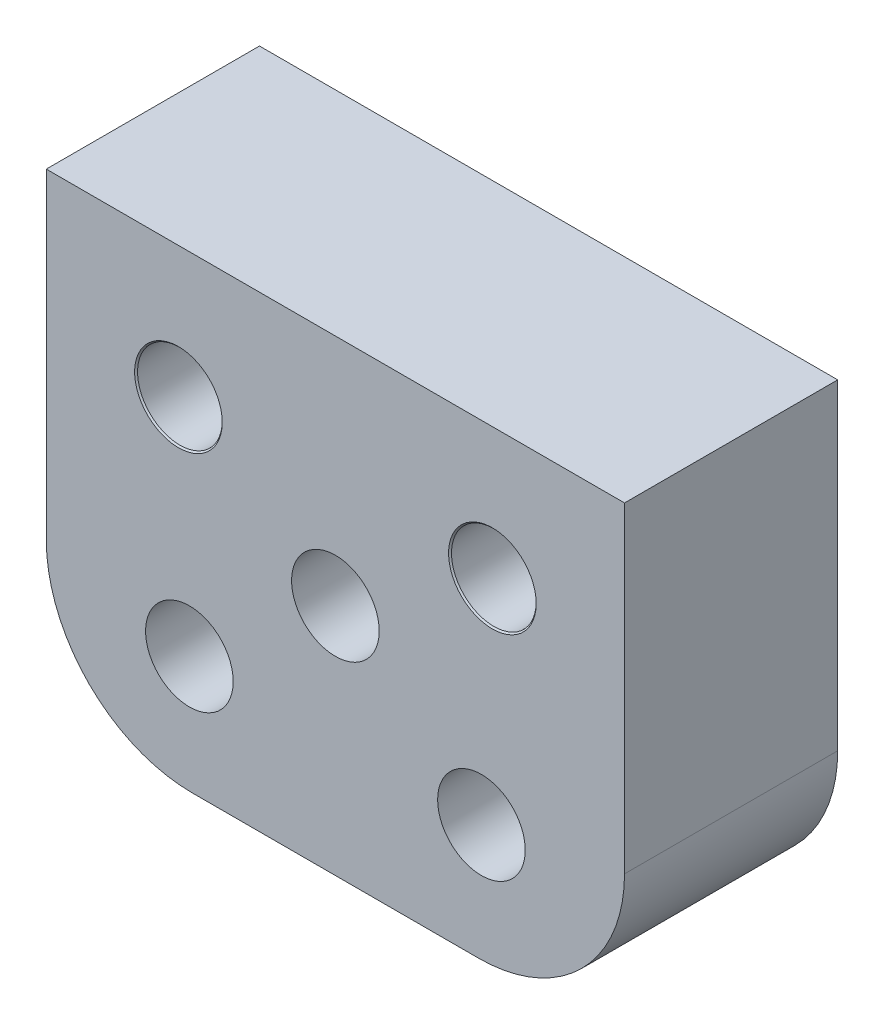
ISO-10303-21;
HEADER;
FILE_DESCRIPTION(('STEP AP214'),'2;1');
FILE_NAME('part.step','',(''),(''),'','','');
FILE_SCHEMA(('AUTOMOTIVE_DESIGN { 1 0 10303 214 1 1 1 1 }'));
ENDSEC;
DATA;
#1=APPLICATION_CONTEXT('core data for automotive mechanical design processes');
#2=APPLICATION_PROTOCOL_DEFINITION('international standard','automotive_design',2000,#1);
#3=PRODUCT_CONTEXT('',#1,'mechanical');
#4=PRODUCT('Part','Part','',(#3));
#5=PRODUCT_RELATED_PRODUCT_CATEGORY('part','',(#4));
#6=PRODUCT_DEFINITION_FORMATION('','',#4);
#7=PRODUCT_DEFINITION_CONTEXT('part definition',#1,'design');
#8=PRODUCT_DEFINITION('design','',#6,#7);
#9=PRODUCT_DEFINITION_SHAPE('','',#8);
#10=(LENGTH_UNIT() NAMED_UNIT(*) SI_UNIT(.MILLI.,.METRE.));
#11=(NAMED_UNIT(*) PLANE_ANGLE_UNIT() SI_UNIT($,.RADIAN.));
#12=(NAMED_UNIT(*) SI_UNIT($,.STERADIAN.) SOLID_ANGLE_UNIT());
#13=UNCERTAINTY_MEASURE_WITH_UNIT(LENGTH_MEASURE(1.E-05),#10,'distance_accuracy_value','');
#14=(GEOMETRIC_REPRESENTATION_CONTEXT(3) GLOBAL_UNCERTAINTY_ASSIGNED_CONTEXT((#13)) GLOBAL_UNIT_ASSIGNED_CONTEXT((#10,
#11,#12)) REPRESENTATION_CONTEXT('',''));
#15=CARTESIAN_POINT('',(0.,0.,0.));
#16=DIRECTION('',(0.,0.,1.));
#17=DIRECTION('',(1.,0.,0.));
#18=AXIS2_PLACEMENT_3D('',#15,#16,#17);
#19=CARTESIAN_POINT('',(19.8,5.00000000000004,-7.3));
#20=DIRECTION('',(1.,0.,0.));
#21=DIRECTION('',(0.,0.,-1.));
#22=AXIS2_PLACEMENT_3D('',#19,#20,#21);
#23=PLANE('',#22);
#24=DIRECTION('',(0.,1.,0.));
#25=VECTOR('',#24,1.);
#26=CARTESIAN_POINT('',(19.8,5.00000000000004,0.));
#27=LINE('',#26,#25);
#28=CARTESIAN_POINT('',(19.8,5.,0.));
#29=VERTEX_POINT('',#28);
#30=CARTESIAN_POINT('',(19.8,16.,0.));
#31=VERTEX_POINT('',#30);
#32=EDGE_CURVE('E121',#29,#31,#27,.T.);
#33=ORIENTED_EDGE('',*,*,#32,.F.);
#34=DIRECTION('',(0.,0.,1.));
#35=VECTOR('',#34,1.);
#36=CARTESIAN_POINT('',(19.8,5.,-7.3));
#37=LINE('',#36,#35);
#38=CARTESIAN_POINT('',(19.8,5.,-7.3));
#39=VERTEX_POINT('',#38);
#40=EDGE_CURVE('E11',#39,#29,#37,.T.);
#41=ORIENTED_EDGE('',*,*,#40,.F.);
#42=DIRECTION('',(0.,1.,0.));
#43=VECTOR('',#42,1.);
#44=CARTESIAN_POINT('',(19.8,5.00000000000004,-7.3));
#45=LINE('',#44,#43);
#46=CARTESIAN_POINT('',(19.8,16.,-7.3));
#47=VERTEX_POINT('',#46);
#48=EDGE_CURVE('E136',#39,#47,#45,.T.);
#49=ORIENTED_EDGE('',*,*,#48,.T.);
#50=DIRECTION('',(0.,0.,1.));
#51=VECTOR('',#50,1.);
#52=CARTESIAN_POINT('',(19.8,16.,-7.3));
#53=LINE('',#52,#51);
#54=EDGE_CURVE('E39',#47,#31,#53,.T.);
#55=ORIENTED_EDGE('',*,*,#54,.T.);
#56=EDGE_LOOP('',(#33,#41,#49,#55));
#57=FACE_BOUND('',#56,.T.);
#58=ADVANCED_FACE('F36',(#57),#23,.T.);
#59=CARTESIAN_POINT('',(14.8,5.,-7.3));
#60=DIRECTION('',(0.,0.,1.));
#61=DIRECTION('',(1.,0.,0.));
#62=AXIS2_PLACEMENT_3D('',#59,#60,#61);
#63=CYLINDRICAL_SURFACE('',#62,5.);
#64=CARTESIAN_POINT('',(14.8,5.,0.));
#65=DIRECTION('',(0.,0.,1.));
#66=DIRECTION('',(1.,0.,0.));
#67=AXIS2_PLACEMENT_3D('',#64,#65,#66);
#68=CIRCLE('',#67,5.);
#69=CARTESIAN_POINT('',(14.8,0.,0.));
#70=VERTEX_POINT('',#69);
#71=EDGE_CURVE('E134',#70,#29,#68,.T.);
#72=ORIENTED_EDGE('',*,*,#71,.F.);
#73=DIRECTION('',(0.,0.,1.));
#74=VECTOR('',#73,1.);
#75=CARTESIAN_POINT('',(14.8,0.,-7.3));
#76=LINE('',#75,#74);
#77=CARTESIAN_POINT('',(14.8,0.,-7.3));
#78=VERTEX_POINT('',#77);
#79=EDGE_CURVE('E45',#78,#70,#76,.T.);
#80=ORIENTED_EDGE('',*,*,#79,.F.);
#81=CARTESIAN_POINT('',(14.8,5.,-7.3));
#82=DIRECTION('',(0.,0.,1.));
#83=DIRECTION('',(1.,0.,0.));
#84=AXIS2_PLACEMENT_3D('',#81,#82,#83);
#85=CIRCLE('',#84,5.);
#86=EDGE_CURVE('E111',#78,#39,#85,.T.);
#87=ORIENTED_EDGE('',*,*,#86,.T.);
#88=ORIENTED_EDGE('',*,*,#40,.T.);
#89=EDGE_LOOP('',(#72,#80,#87,#88));
#90=FACE_BOUND('',#89,.T.);
#91=ADVANCED_FACE('F144',(#90),#63,.T.);
#92=CARTESIAN_POINT('',(5.00000000000004,0.,-7.3));
#93=DIRECTION('',(0.,-1.,0.));
#94=DIRECTION('',(0.,0.,-1.));
#95=AXIS2_PLACEMENT_3D('',#92,#93,#94);
#96=PLANE('',#95);
#97=DIRECTION('',(1.,0.,0.));
#98=VECTOR('',#97,1.);
#99=CARTESIAN_POINT('',(5.00000000000004,0.,0.));
#100=LINE('',#99,#98);
#101=CARTESIAN_POINT('',(5.00000000000003,0.,0.));
#102=VERTEX_POINT('',#101);
#103=EDGE_CURVE('E98',#102,#70,#100,.T.);
#104=ORIENTED_EDGE('',*,*,#103,.F.);
#105=DIRECTION('',(0.,0.,1.));
#106=VECTOR('',#105,1.);
#107=CARTESIAN_POINT('',(5.00000000000003,0.,-7.3));
#108=LINE('',#107,#106);
#109=CARTESIAN_POINT('',(5.00000000000003,0.,-7.3));
#110=VERTEX_POINT('',#109);
#111=EDGE_CURVE('E93',#110,#102,#108,.T.);
#112=ORIENTED_EDGE('',*,*,#111,.F.);
#113=DIRECTION('',(1.,0.,0.));
#114=VECTOR('',#113,1.);
#115=CARTESIAN_POINT('',(5.00000000000004,0.,-7.3));
#116=LINE('',#115,#114);
#117=EDGE_CURVE('E96',#110,#78,#116,.T.);
#118=ORIENTED_EDGE('',*,*,#117,.T.);
#119=ORIENTED_EDGE('',*,*,#79,.T.);
#120=EDGE_LOOP('',(#104,#112,#118,#119));
#121=FACE_BOUND('',#120,.T.);
#122=ADVANCED_FACE('F95',(#121),#96,.T.);
#123=CARTESIAN_POINT('',(5.,5.,-7.3));
#124=DIRECTION('',(0.,0.,1.));
#125=DIRECTION('',(1.,0.,0.));
#126=AXIS2_PLACEMENT_3D('',#123,#124,#125);
#127=CYLINDRICAL_SURFACE('',#126,5.);
#128=CARTESIAN_POINT('',(5.,5.,0.));
#129=DIRECTION('',(0.,0.,1.));
#130=DIRECTION('',(1.,0.,0.));
#131=AXIS2_PLACEMENT_3D('',#128,#129,#130);
#132=CIRCLE('',#131,5.);
#133=CARTESIAN_POINT('',(0.,5.00000000000004,0.));
#134=VERTEX_POINT('',#133);
#135=EDGE_CURVE('E131',#134,#102,#132,.T.);
#136=ORIENTED_EDGE('',*,*,#135,.F.);
#137=DIRECTION('',(0.,0.,1.));
#138=VECTOR('',#137,1.);
#139=CARTESIAN_POINT('',(0.,5.00000000000004,-7.3));
#140=LINE('',#139,#138);
#141=CARTESIAN_POINT('',(0.,5.00000000000004,-7.3));
#142=VERTEX_POINT('',#141);
#143=EDGE_CURVE('E103',#142,#134,#140,.T.);
#144=ORIENTED_EDGE('',*,*,#143,.F.);
#145=CARTESIAN_POINT('',(5.,5.,-7.3));
#146=DIRECTION('',(0.,0.,1.));
#147=DIRECTION('',(1.,0.,0.));
#148=AXIS2_PLACEMENT_3D('',#145,#146,#147);
#149=CIRCLE('',#148,5.);
#150=EDGE_CURVE('E109',#142,#110,#149,.T.);
#151=ORIENTED_EDGE('',*,*,#150,.T.);
#152=ORIENTED_EDGE('',*,*,#111,.T.);
#153=EDGE_LOOP('',(#136,#144,#151,#152));
#154=FACE_BOUND('',#153,.T.);
#155=ADVANCED_FACE('F113',(#154),#127,.T.);
#156=CARTESIAN_POINT('',(0.,5.00000000000004,-7.3));
#157=DIRECTION('',(-1.,0.,0.));
#158=DIRECTION('',(0.,0.,1.));
#159=AXIS2_PLACEMENT_3D('',#156,#157,#158);
#160=PLANE('',#159);
#161=DIRECTION('',(0.,-1.,0.));
#162=VECTOR('',#161,1.);
#163=CARTESIAN_POINT('',(0.,5.00000000000004,0.));
#164=LINE('',#163,#162);
#165=CARTESIAN_POINT('',(0.,16.,0.));
#166=VERTEX_POINT('',#165);
#167=EDGE_CURVE('E128',#166,#134,#164,.T.);
#168=ORIENTED_EDGE('',*,*,#167,.F.);
#169=DIRECTION('',(0.,0.,1.));
#170=VECTOR('',#169,1.);
#171=CARTESIAN_POINT('',(0.,16.,-7.3));
#172=LINE('',#171,#170);
#173=CARTESIAN_POINT('',(0.,16.,-7.3));
#174=VERTEX_POINT('',#173);
#175=EDGE_CURVE('E139',#174,#166,#172,.T.);
#176=ORIENTED_EDGE('',*,*,#175,.F.);
#177=DIRECTION('',(0.,-1.,0.));
#178=VECTOR('',#177,1.);
#179=CARTESIAN_POINT('',(0.,5.00000000000004,-7.3));
#180=LINE('',#179,#178);
#181=EDGE_CURVE('E114',#174,#142,#180,.T.);
#182=ORIENTED_EDGE('',*,*,#181,.T.);
#183=ORIENTED_EDGE('',*,*,#143,.T.);
#184=EDGE_LOOP('',(#168,#176,#182,#183));
#185=FACE_BOUND('',#184,.T.);
#186=ADVANCED_FACE('F157',(#185),#160,.T.);
#187=CARTESIAN_POINT('',(0.,16.,-7.3));
#188=DIRECTION('',(0.,1.,0.));
#189=DIRECTION('',(0.,0.,1.));
#190=AXIS2_PLACEMENT_3D('',#187,#188,#189);
#191=PLANE('',#190);
#192=DIRECTION('',(-1.,0.,0.));
#193=VECTOR('',#192,1.);
#194=CARTESIAN_POINT('',(0.,16.,0.));
#195=LINE('',#194,#193);
#196=EDGE_CURVE('E124',#31,#166,#195,.T.);
#197=ORIENTED_EDGE('',*,*,#196,.F.);
#198=ORIENTED_EDGE('',*,*,#54,.F.);
#199=DIRECTION('',(-1.,0.,0.));
#200=VECTOR('',#199,1.);
#201=CARTESIAN_POINT('',(0.,16.,-7.3));
#202=LINE('',#201,#200);
#203=EDGE_CURVE('E116',#47,#174,#202,.T.);
#204=ORIENTED_EDGE('',*,*,#203,.T.);
#205=ORIENTED_EDGE('',*,*,#175,.T.);
#206=EDGE_LOOP('',(#197,#198,#204,#205));
#207=FACE_BOUND('',#206,.T.);
#208=ADVANCED_FACE('F141',(#207),#191,.T.);
#209=CARTESIAN_POINT('',(5.,5.,-7.3));
#210=DIRECTION('',(0.,0.,1.));
#211=DIRECTION('',(1.,0.,0.));
#212=AXIS2_PLACEMENT_3D('',#209,#210,#211);
#213=PLANE('',#212);
#214=CARTESIAN_POINT('',(4.525,11.5,-7.3));
#215=DIRECTION('',(0.,0.,1.));
#216=DIRECTION('',(1.,0.,0.));
#217=AXIS2_PLACEMENT_3D('',#214,#215,#216);
#218=CIRCLE('',#217,1.5);
#219=CARTESIAN_POINT('',(6.025,11.5,-7.3));
#220=VERTEX_POINT('',#219);
#221=EDGE_CURVE('E216',#220,#220,#218,.T.);
#222=ORIENTED_EDGE('',*,*,#221,.T.);
#223=EDGE_LOOP('',(#222));
#224=FACE_BOUND('',#223,.T.);
#225=CARTESIAN_POINT('',(15.275,11.5,-7.3));
#226=DIRECTION('',(0.,0.,1.));
#227=DIRECTION('',(1.,0.,0.));
#228=AXIS2_PLACEMENT_3D('',#225,#226,#227);
#229=CIRCLE('',#228,1.5);
#230=CARTESIAN_POINT('',(16.775,11.5,-7.3));
#231=VERTEX_POINT('',#230);
#232=EDGE_CURVE('E224',#231,#231,#229,.T.);
#233=ORIENTED_EDGE('',*,*,#232,.T.);
#234=EDGE_LOOP('',(#233));
#235=FACE_BOUND('',#234,.T.);
#236=CARTESIAN_POINT('',(14.9,4.,-7.3));
#237=DIRECTION('',(0.,0.,1.));
#238=DIRECTION('',(-1.,0.,0.));
#239=AXIS2_PLACEMENT_3D('',#236,#237,#238);
#240=CIRCLE('',#239,1.5);
#241=CARTESIAN_POINT('',(13.4,4.,-7.3));
#242=VERTEX_POINT('',#241);
#243=EDGE_CURVE('E237',#242,#242,#240,.T.);
#244=ORIENTED_EDGE('',*,*,#243,.T.);
#245=EDGE_LOOP('',(#244));
#246=FACE_BOUND('',#245,.T.);
#247=CARTESIAN_POINT('',(4.9,4.,-7.3));
#248=DIRECTION('',(0.,0.,1.));
#249=DIRECTION('',(1.,0.,0.));
#250=AXIS2_PLACEMENT_3D('',#247,#248,#249);
#251=CIRCLE('',#250,1.5);
#252=CARTESIAN_POINT('',(6.4,4.,-7.3));
#253=VERTEX_POINT('',#252);
#254=EDGE_CURVE('E243',#253,#253,#251,.T.);
#255=ORIENTED_EDGE('',*,*,#254,.T.);
#256=EDGE_LOOP('',(#255));
#257=FACE_BOUND('',#256,.T.);
#258=CARTESIAN_POINT('',(9.9,8.,-7.3));
#259=DIRECTION('',(0.,0.,1.));
#260=DIRECTION('',(1.,0.,0.));
#261=AXIS2_PLACEMENT_3D('',#258,#259,#260);
#262=CIRCLE('',#261,1.5);
#263=CARTESIAN_POINT('',(11.4,8.,-7.3));
#264=VERTEX_POINT('',#263);
#265=EDGE_CURVE('E125',#264,#264,#262,.T.);
#266=ORIENTED_EDGE('',*,*,#265,.T.);
#267=EDGE_LOOP('',(#266));
#268=FACE_BOUND('',#267,.T.);
#269=ORIENTED_EDGE('',*,*,#48,.F.);
#270=ORIENTED_EDGE('',*,*,#86,.F.);
#271=ORIENTED_EDGE('',*,*,#117,.F.);
#272=ORIENTED_EDGE('',*,*,#150,.F.);
#273=ORIENTED_EDGE('',*,*,#181,.F.);
#274=ORIENTED_EDGE('',*,*,#203,.F.);
#275=EDGE_LOOP('',(#269,#270,#271,#272,#273,#274));
#276=FACE_BOUND('',#275,.T.);
#277=ADVANCED_FACE('F107',(#224,#235,#246,#257,#268,#276),#213,.F.);
#278=CARTESIAN_POINT('',(5.,5.,0.));
#279=DIRECTION('',(0.,0.,1.));
#280=DIRECTION('',(1.,0.,0.));
#281=AXIS2_PLACEMENT_3D('',#278,#279,#280);
#282=PLANE('',#281);
#283=CARTESIAN_POINT('',(4.525,11.5,0.));
#284=DIRECTION('',(0.,0.,1.));
#285=DIRECTION('',(1.,0.,0.));
#286=AXIS2_PLACEMENT_3D('',#283,#284,#285);
#287=CIRCLE('',#286,1.5);
#288=CARTESIAN_POINT('',(6.025,11.5,0.));
#289=VERTEX_POINT('',#288);
#290=EDGE_CURVE('E215',#289,#289,#287,.T.);
#291=ORIENTED_EDGE('',*,*,#290,.F.);
#292=EDGE_LOOP('',(#291));
#293=FACE_BOUND('',#292,.T.);
#294=CARTESIAN_POINT('',(15.275,11.5,0.));
#295=DIRECTION('',(0.,0.,1.));
#296=DIRECTION('',(1.,0.,0.));
#297=AXIS2_PLACEMENT_3D('',#294,#295,#296);
#298=CIRCLE('',#297,1.5);
#299=CARTESIAN_POINT('',(16.775,11.5,0.));
#300=VERTEX_POINT('',#299);
#301=EDGE_CURVE('E227',#300,#300,#298,.T.);
#302=ORIENTED_EDGE('',*,*,#301,.F.);
#303=EDGE_LOOP('',(#302));
#304=FACE_BOUND('',#303,.T.);
#305=CARTESIAN_POINT('',(14.9,4.,0.));
#306=DIRECTION('',(0.,0.,1.));
#307=DIRECTION('',(-1.,0.,0.));
#308=AXIS2_PLACEMENT_3D('',#305,#306,#307);
#309=CIRCLE('',#308,1.5);
#310=CARTESIAN_POINT('',(13.4,4.,0.));
#311=VERTEX_POINT('',#310);
#312=EDGE_CURVE('E236',#311,#311,#309,.T.);
#313=ORIENTED_EDGE('',*,*,#312,.F.);
#314=EDGE_LOOP('',(#313));
#315=FACE_BOUND('',#314,.T.);
#316=CARTESIAN_POINT('',(4.9,4.,0.));
#317=DIRECTION('',(0.,0.,1.));
#318=DIRECTION('',(1.,0.,0.));
#319=AXIS2_PLACEMENT_3D('',#316,#317,#318);
#320=CIRCLE('',#319,1.5);
#321=CARTESIAN_POINT('',(6.4,4.,0.));
#322=VERTEX_POINT('',#321);
#323=EDGE_CURVE('E240',#322,#322,#320,.T.);
#324=ORIENTED_EDGE('',*,*,#323,.F.);
#325=EDGE_LOOP('',(#324));
#326=FACE_BOUND('',#325,.T.);
#327=CARTESIAN_POINT('',(9.9,8.,0.));
#328=DIRECTION('',(0.,0.,1.));
#329=DIRECTION('',(1.,0.,0.));
#330=AXIS2_PLACEMENT_3D('',#327,#328,#329);
#331=CIRCLE('',#330,1.5);
#332=CARTESIAN_POINT('',(11.4,8.,0.));
#333=VERTEX_POINT('',#332);
#334=EDGE_CURVE('E246',#333,#333,#331,.T.);
#335=ORIENTED_EDGE('',*,*,#334,.F.);
#336=EDGE_LOOP('',(#335));
#337=FACE_BOUND('',#336,.T.);
#338=ORIENTED_EDGE('',*,*,#32,.T.);
#339=ORIENTED_EDGE('',*,*,#196,.T.);
#340=ORIENTED_EDGE('',*,*,#167,.T.);
#341=ORIENTED_EDGE('',*,*,#135,.T.);
#342=ORIENTED_EDGE('',*,*,#103,.T.);
#343=ORIENTED_EDGE('',*,*,#71,.T.);
#344=EDGE_LOOP('',(#338,#339,#340,#341,#342,#343));
#345=FACE_BOUND('',#344,.T.);
#346=ADVANCED_FACE('F143',(#293,#304,#315,#326,#337,#345),#282,.T.);
#347=CARTESIAN_POINT('',(9.9,8.,-7.3));
#348=DIRECTION('',(0.,0.,1.));
#349=DIRECTION('',(1.,0.,0.));
#350=AXIS2_PLACEMENT_3D('',#347,#348,#349);
#351=CYLINDRICAL_SURFACE('',#350,1.5);
#352=ORIENTED_EDGE('',*,*,#265,.F.);
#353=EDGE_LOOP('',(#352));
#354=FACE_BOUND('',#353,.T.);
#355=ORIENTED_EDGE('',*,*,#334,.T.);
#356=EDGE_LOOP('',(#355));
#357=FACE_BOUND('',#356,.T.);
#358=ADVANCED_FACE('F168',(#354,#357),#351,.F.);
#359=CARTESIAN_POINT('',(4.9,4.,-7.3));
#360=DIRECTION('',(0.,0.,1.));
#361=DIRECTION('',(1.,0.,0.));
#362=AXIS2_PLACEMENT_3D('',#359,#360,#361);
#363=CYLINDRICAL_SURFACE('',#362,1.5);
#364=ORIENTED_EDGE('',*,*,#254,.F.);
#365=EDGE_LOOP('',(#364));
#366=FACE_BOUND('',#365,.T.);
#367=ORIENTED_EDGE('',*,*,#323,.T.);
#368=EDGE_LOOP('',(#367));
#369=FACE_BOUND('',#368,.T.);
#370=ADVANCED_FACE('F175',(#366,#369),#363,.F.);
#371=CARTESIAN_POINT('',(14.9,4.,-7.3));
#372=DIRECTION('',(0.,0.,1.));
#373=DIRECTION('',(1.,0.,0.));
#374=AXIS2_PLACEMENT_3D('',#371,#372,#373);
#375=CYLINDRICAL_SURFACE('',#374,1.5);
#376=ORIENTED_EDGE('',*,*,#243,.F.);
#377=EDGE_LOOP('',(#376));
#378=FACE_BOUND('',#377,.T.);
#379=ORIENTED_EDGE('',*,*,#312,.T.);
#380=EDGE_LOOP('',(#379));
#381=FACE_BOUND('',#380,.T.);
#382=ADVANCED_FACE('F179',(#378,#381),#375,.F.);
#383=CARTESIAN_POINT('',(15.275,11.5,-7.25));
#384=DIRECTION('',(0.,0.,-1.));
#385=DIRECTION('',(-1.,0.,0.));
#386=AXIS2_PLACEMENT_3D('',#383,#384,#385);
#387=CONICAL_SURFACE('',#386,1.45,0.785398163397457);
#388=ORIENTED_EDGE('',*,*,#232,.F.);
#389=EDGE_LOOP('',(#388));
#390=FACE_BOUND('',#389,.T.);
#391=CARTESIAN_POINT('',(15.275,11.5,-7.25));
#392=DIRECTION('',(0.,0.,1.));
#393=DIRECTION('',(1.,0.,0.));
#394=AXIS2_PLACEMENT_3D('',#391,#392,#393);
#395=CIRCLE('',#394,1.45);
#396=CARTESIAN_POINT('',(16.725,11.5,-7.25));
#397=VERTEX_POINT('',#396);
#398=EDGE_CURVE('E233',#397,#397,#395,.T.);
#399=ORIENTED_EDGE('',*,*,#398,.T.);
#400=EDGE_LOOP('',(#399));
#401=FACE_BOUND('',#400,.T.);
#402=ADVANCED_FACE('F183',(#390,#401),#387,.F.);
#403=CARTESIAN_POINT('',(15.275,11.5,0.));
#404=DIRECTION('',(0.,0.,1.));
#405=DIRECTION('',(1.,0.,0.));
#406=AXIS2_PLACEMENT_3D('',#403,#404,#405);
#407=CYLINDRICAL_SURFACE('',#406,1.45);
#408=ORIENTED_EDGE('',*,*,#398,.F.);
#409=EDGE_LOOP('',(#408));
#410=FACE_BOUND('',#409,.T.);
#411=CARTESIAN_POINT('',(15.275,11.5,-0.0500000000000014));
#412=DIRECTION('',(0.,0.,1.));
#413=DIRECTION('',(1.,0.,0.));
#414=AXIS2_PLACEMENT_3D('',#411,#412,#413);
#415=CIRCLE('',#414,1.45);
#416=CARTESIAN_POINT('',(16.725,11.5,-0.0500000000000014));
#417=VERTEX_POINT('',#416);
#418=EDGE_CURVE('E230',#417,#417,#415,.T.);
#419=ORIENTED_EDGE('',*,*,#418,.T.);
#420=EDGE_LOOP('',(#419));
#421=FACE_BOUND('',#420,.T.);
#422=ADVANCED_FACE('F187',(#410,#421),#407,.F.);
#423=CARTESIAN_POINT('',(15.275,11.5,0.));
#424=DIRECTION('',(0.,0.,1.));
#425=DIRECTION('',(1.,0.,0.));
#426=AXIS2_PLACEMENT_3D('',#423,#424,#425);
#427=CONICAL_SURFACE('',#426,1.5,0.785398163397448);
#428=ORIENTED_EDGE('',*,*,#418,.F.);
#429=EDGE_LOOP('',(#428));
#430=FACE_BOUND('',#429,.T.);
#431=ORIENTED_EDGE('',*,*,#301,.T.);
#432=EDGE_LOOP('',(#431));
#433=FACE_BOUND('',#432,.T.);
#434=ADVANCED_FACE('F191',(#430,#433),#427,.F.);
#435=CARTESIAN_POINT('',(4.525,11.5,-7.25));
#436=DIRECTION('',(0.,0.,-1.));
#437=DIRECTION('',(-1.,0.,0.));
#438=AXIS2_PLACEMENT_3D('',#435,#436,#437);
#439=CONICAL_SURFACE('',#438,1.45,0.785398163397448);
#440=ORIENTED_EDGE('',*,*,#221,.F.);
#441=EDGE_LOOP('',(#440));
#442=FACE_BOUND('',#441,.T.);
#443=CARTESIAN_POINT('',(4.525,11.5,-7.25));
#444=DIRECTION('',(0.,0.,1.));
#445=DIRECTION('',(1.,0.,0.));
#446=AXIS2_PLACEMENT_3D('',#443,#444,#445);
#447=CIRCLE('',#446,1.45);
#448=CARTESIAN_POINT('',(5.975,11.5,-7.25));
#449=VERTEX_POINT('',#448);
#450=EDGE_CURVE('E218',#449,#449,#447,.T.);
#451=ORIENTED_EDGE('',*,*,#450,.T.);
#452=EDGE_LOOP('',(#451));
#453=FACE_BOUND('',#452,.T.);
#454=ADVANCED_FACE('F195',(#442,#453),#439,.F.);
#455=CARTESIAN_POINT('',(4.525,11.5,0.));
#456=DIRECTION('',(0.,0.,1.));
#457=DIRECTION('',(1.,0.,0.));
#458=AXIS2_PLACEMENT_3D('',#455,#456,#457);
#459=CYLINDRICAL_SURFACE('',#458,1.45);
#460=ORIENTED_EDGE('',*,*,#450,.F.);
#461=EDGE_LOOP('',(#460));
#462=FACE_BOUND('',#461,.T.);
#463=CARTESIAN_POINT('',(4.525,11.5,-0.0500000000000014));
#464=DIRECTION('',(0.,0.,1.));
#465=DIRECTION('',(1.,0.,0.));
#466=AXIS2_PLACEMENT_3D('',#463,#464,#465);
#467=CIRCLE('',#466,1.45);
#468=CARTESIAN_POINT('',(5.975,11.5,-0.0500000000000014));
#469=VERTEX_POINT('',#468);
#470=EDGE_CURVE('E212',#469,#469,#467,.T.);
#471=ORIENTED_EDGE('',*,*,#470,.T.);
#472=EDGE_LOOP('',(#471));
#473=FACE_BOUND('',#472,.T.);
#474=ADVANCED_FACE('F199',(#462,#473),#459,.F.);
#475=CARTESIAN_POINT('',(4.525,11.5,0.));
#476=DIRECTION('',(0.,0.,1.));
#477=DIRECTION('',(1.,0.,0.));
#478=AXIS2_PLACEMENT_3D('',#475,#476,#477);
#479=CONICAL_SURFACE('',#478,1.5,0.785398163397448);
#480=ORIENTED_EDGE('',*,*,#470,.F.);
#481=EDGE_LOOP('',(#480));
#482=FACE_BOUND('',#481,.T.);
#483=ORIENTED_EDGE('',*,*,#290,.T.);
#484=EDGE_LOOP('',(#483));
#485=FACE_BOUND('',#484,.T.);
#486=ADVANCED_FACE('F203',(#482,#485),#479,.F.);
#487=CLOSED_SHELL('',(#58,#91,#122,#155,#186,#208,#277,#346,#358,#370,#382,#402,#422,#434,#454,
#474,#486));
#488=MANIFOLD_SOLID_BREP('B2',#487);
#489=ADVANCED_BREP_SHAPE_REPRESENTATION('',(#18,#488),#14);
#490=SHAPE_DEFINITION_REPRESENTATION(#9,#489);
ENDSEC;
END-ISO-10303-21;
